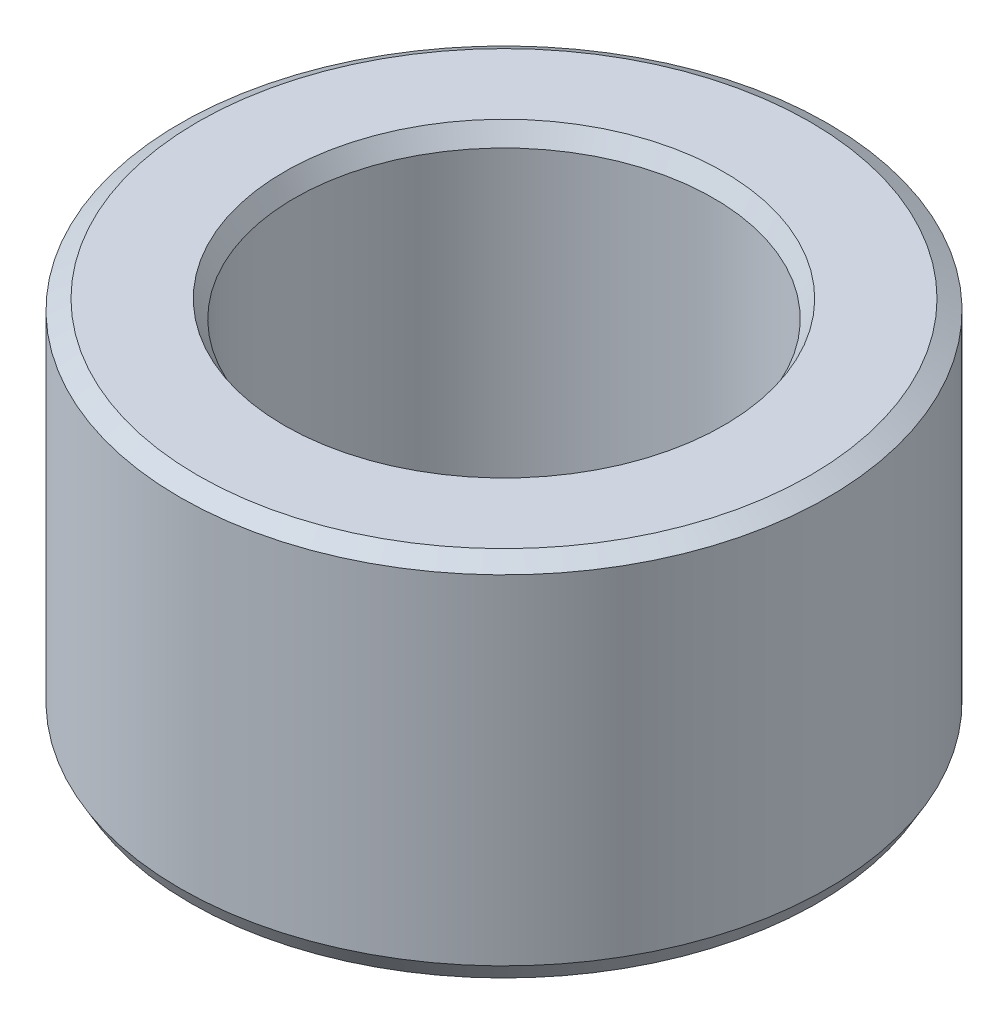
ISO-10303-21;
HEADER;
FILE_DESCRIPTION(('STEP AP214'),'2;1');
FILE_NAME('part.step','',(''),(''),'','','');
FILE_SCHEMA(('AUTOMOTIVE_DESIGN { 1 0 10303 214 1 1 1 1 }'));
ENDSEC;
DATA;
#1=APPLICATION_CONTEXT('core data for automotive mechanical design processes');
#2=APPLICATION_PROTOCOL_DEFINITION('international standard','automotive_design',2000,#1);
#3=PRODUCT_CONTEXT('',#1,'mechanical');
#4=PRODUCT('Part','Part','',(#3));
#5=PRODUCT_RELATED_PRODUCT_CATEGORY('part','',(#4));
#6=PRODUCT_DEFINITION_FORMATION('','',#4);
#7=PRODUCT_DEFINITION_CONTEXT('part definition',#1,'design');
#8=PRODUCT_DEFINITION('design','',#6,#7);
#9=PRODUCT_DEFINITION_SHAPE('','',#8);
#10=(LENGTH_UNIT() NAMED_UNIT(*) SI_UNIT(.MILLI.,.METRE.));
#11=(NAMED_UNIT(*) PLANE_ANGLE_UNIT() SI_UNIT($,.RADIAN.));
#12=(NAMED_UNIT(*) SI_UNIT($,.STERADIAN.) SOLID_ANGLE_UNIT());
#13=UNCERTAINTY_MEASURE_WITH_UNIT(LENGTH_MEASURE(1.E-05),#10,'distance_accuracy_value','');
#14=(GEOMETRIC_REPRESENTATION_CONTEXT(3) GLOBAL_UNCERTAINTY_ASSIGNED_CONTEXT((#13)) GLOBAL_UNIT_ASSIGNED_CONTEXT((#10,
#11,#12)) REPRESENTATION_CONTEXT('',''));
#15=CARTESIAN_POINT('',(0.,0.,0.));
#16=DIRECTION('',(0.,0.,1.));
#17=DIRECTION('',(1.,0.,0.));
#18=AXIS2_PLACEMENT_3D('',#15,#16,#17);
#19=CARTESIAN_POINT('',(0.,56.584841401643,0.));
#20=DIRECTION('',(0.,-1.,0.));
#21=DIRECTION('',(0.,0.,-1.));
#22=AXIS2_PLACEMENT_3D('',#19,#20,#21);
#23=CYLINDRICAL_SURFACE('',#22,50.);
#24=CARTESIAN_POINT('',(0.,2.73086601669988,0.));
#25=DIRECTION('',(0.,1.,0.));
#26=DIRECTION('',(0.,0.,1.));
#27=AXIS2_PLACEMENT_3D('',#24,#25,#26);
#28=CIRCLE('',#27,50.);
#29=CARTESIAN_POINT('',(0.,2.73086601669988,50.));
#30=VERTEX_POINT('',#29);
#31=EDGE_CURVE('E10',#30,#30,#28,.T.);
#32=ORIENTED_EDGE('',*,*,#31,.T.);
#33=EDGE_LOOP('',(#32));
#34=FACE_BOUND('',#33,.T.);
#35=CARTESIAN_POINT('',(0.,55.0081751717805,0.));
#36=DIRECTION('',(0.,1.,0.));
#37=DIRECTION('',(0.,0.,1.));
#38=AXIS2_PLACEMENT_3D('',#35,#36,#37);
#39=CIRCLE('',#38,50.);
#40=CARTESIAN_POINT('',(0.,55.0081751717805,50.));
#41=VERTEX_POINT('',#40);
#42=EDGE_CURVE('E50',#41,#41,#39,.F.);
#43=ORIENTED_EDGE('',*,*,#42,.T.);
#44=EDGE_LOOP('',(#43));
#45=FACE_BOUND('',#44,.T.);
#46=ADVANCED_FACE('F39',(#34,#45),#23,.T.);
#47=CARTESIAN_POINT('',(0.,56.584841401643,0.));
#48=DIRECTION('',(0.,1.,0.));
#49=DIRECTION('',(0.,0.,1.));
#50=AXIS2_PLACEMENT_3D('',#47,#48,#49);
#51=PLANE('',#50);
#52=CARTESIAN_POINT('',(0.,56.584841401643,0.));
#53=DIRECTION('',(0.,1.,0.));
#54=DIRECTION('',(0.,0.,1.));
#55=AXIS2_PLACEMENT_3D('',#52,#53,#54);
#56=CIRCLE('',#55,33.9172804695597);
#57=CARTESIAN_POINT('',(0.,56.584841401643,33.9172804695597));
#58=VERTEX_POINT('',#57);
#59=EDGE_CURVE('E58',#58,#58,#56,.F.);
#60=ORIENTED_EDGE('',*,*,#59,.T.);
#61=EDGE_LOOP('',(#60));
#62=FACE_BOUND('',#61,.T.);
#63=CARTESIAN_POINT('',(0.,56.584841401643,0.));
#64=DIRECTION('',(0.,1.,0.));
#65=DIRECTION('',(0.,0.,1.));
#66=AXIS2_PLACEMENT_3D('',#63,#64,#65);
#67=CIRCLE('',#66,47.2691339833001);
#68=CARTESIAN_POINT('',(0.,56.584841401643,47.2691339833001));
#69=VERTEX_POINT('',#68);
#70=EDGE_CURVE('E61',#69,#69,#67,.T.);
#71=ORIENTED_EDGE('',*,*,#70,.T.);
#72=EDGE_LOOP('',(#71));
#73=FACE_BOUND('',#72,.T.);
#74=ADVANCED_FACE('F88',(#62,#73),#51,.T.);
#75=CARTESIAN_POINT('',(0.,0.,0.));
#76=DIRECTION('',(0.,1.,0.));
#77=DIRECTION('',(0.,0.,1.));
#78=AXIS2_PLACEMENT_3D('',#75,#76,#77);
#79=PLANE('',#78);
#80=CARTESIAN_POINT('',(0.,0.,0.));
#81=DIRECTION('',(0.,1.,0.));
#82=DIRECTION('',(0.,0.,1.));
#83=AXIS2_PLACEMENT_3D('',#80,#81,#82);
#84=CIRCLE('',#83,35.0714802563971);
#85=CARTESIAN_POINT('',(0.,0.,35.0714802563971));
#86=VERTEX_POINT('',#85);
#87=EDGE_CURVE('E51',#86,#86,#84,.T.);
#88=ORIENTED_EDGE('',*,*,#87,.T.);
#89=EDGE_LOOP('',(#88));
#90=FACE_BOUND('',#89,.T.);
#91=CARTESIAN_POINT('',(0.,0.,0.));
#92=DIRECTION('',(0.,1.,0.));
#93=DIRECTION('',(0.,0.,1.));
#94=AXIS2_PLACEMENT_3D('',#91,#92,#93);
#95=CIRCLE('',#94,48.4233337701375);
#96=CARTESIAN_POINT('',(0.,0.,48.4233337701375));
#97=VERTEX_POINT('',#96);
#98=EDGE_CURVE('E54',#97,#97,#95,.F.);
#99=ORIENTED_EDGE('',*,*,#98,.T.);
#100=EDGE_LOOP('',(#99));
#101=FACE_BOUND('',#100,.T.);
#102=ADVANCED_FACE('F83',(#90,#101),#79,.F.);
#103=CARTESIAN_POINT('',(0.,56.584841401643,0.));
#104=DIRECTION('',(0.,-1.,0.));
#105=DIRECTION('',(0.,0.,-1.));
#106=AXIS2_PLACEMENT_3D('',#103,#104,#105);
#107=CYLINDRICAL_SURFACE('',#106,32.3406142396972);
#108=CARTESIAN_POINT('',(0.,53.8539753849431,0.));
#109=DIRECTION('',(0.,1.,0.));
#110=DIRECTION('',(0.,0.,1.));
#111=AXIS2_PLACEMENT_3D('',#108,#109,#110);
#112=CIRCLE('',#111,32.3406142396972);
#113=CARTESIAN_POINT('',(0.,53.8539753849431,32.3406142396972));
#114=VERTEX_POINT('',#113);
#115=EDGE_CURVE('E67',#114,#114,#112,.T.);
#116=ORIENTED_EDGE('',*,*,#115,.T.);
#117=EDGE_LOOP('',(#116));
#118=FACE_BOUND('',#117,.T.);
#119=CARTESIAN_POINT('',(0.,1.5766662298625,0.));
#120=DIRECTION('',(0.,1.,0.));
#121=DIRECTION('',(0.,0.,1.));
#122=AXIS2_PLACEMENT_3D('',#119,#120,#121);
#123=CIRCLE('',#122,32.3406142396972);
#124=CARTESIAN_POINT('',(0.,1.5766662298625,32.3406142396972));
#125=VERTEX_POINT('',#124);
#126=EDGE_CURVE('E69',#125,#125,#123,.F.);
#127=ORIENTED_EDGE('',*,*,#126,.T.);
#128=EDGE_LOOP('',(#127));
#129=FACE_BOUND('',#128,.T.);
#130=ADVANCED_FACE('F71',(#118,#129),#107,.F.);
#131=CARTESIAN_POINT('',(0.,53.8539753849431,0.));
#132=DIRECTION('',(0.,1.,0.));
#133=DIRECTION('',(0.,0.,1.));
#134=AXIS2_PLACEMENT_3D('',#131,#132,#133);
#135=CONICAL_SURFACE('',#134,32.3406142396972,0.523598775598304);
#136=ORIENTED_EDGE('',*,*,#59,.F.);
#137=EDGE_LOOP('',(#136));
#138=FACE_BOUND('',#137,.T.);
#139=ORIENTED_EDGE('',*,*,#115,.F.);
#140=EDGE_LOOP('',(#139));
#141=FACE_BOUND('',#140,.T.);
#142=ADVANCED_FACE('F77',(#138,#141),#135,.F.);
#143=CARTESIAN_POINT('',(0.,0.,0.));
#144=DIRECTION('',(0.,-1.,0.));
#145=DIRECTION('',(0.,0.,-1.));
#146=AXIS2_PLACEMENT_3D('',#143,#144,#145);
#147=CONICAL_SURFACE('',#146,35.0714802563971,1.04719755119659);
#148=ORIENTED_EDGE('',*,*,#126,.F.);
#149=EDGE_LOOP('',(#148));
#150=FACE_BOUND('',#149,.T.);
#151=ORIENTED_EDGE('',*,*,#87,.F.);
#152=EDGE_LOOP('',(#151));
#153=FACE_BOUND('',#152,.T.);
#154=ADVANCED_FACE('F73',(#150,#153),#147,.F.);
#155=CARTESIAN_POINT('',(0.,2.73086601669988,0.));
#156=DIRECTION('',(0.,1.,0.));
#157=DIRECTION('',(0.,0.,1.));
#158=AXIS2_PLACEMENT_3D('',#155,#156,#157);
#159=CONICAL_SURFACE('',#158,50.,0.523598775598304);
#160=ORIENTED_EDGE('',*,*,#98,.F.);
#161=EDGE_LOOP('',(#160));
#162=FACE_BOUND('',#161,.T.);
#163=ORIENTED_EDGE('',*,*,#31,.F.);
#164=EDGE_LOOP('',(#163));
#165=FACE_BOUND('',#164,.T.);
#166=ADVANCED_FACE('F76',(#162,#165),#159,.T.);
#167=CARTESIAN_POINT('',(0.,56.584841401643,0.));
#168=DIRECTION('',(0.,-1.,0.));
#169=DIRECTION('',(0.,0.,-1.));
#170=AXIS2_PLACEMENT_3D('',#167,#168,#169);
#171=CONICAL_SURFACE('',#170,47.2691339833001,1.04719755119659);
#172=ORIENTED_EDGE('',*,*,#42,.F.);
#173=EDGE_LOOP('',(#172));
#174=FACE_BOUND('',#173,.T.);
#175=ORIENTED_EDGE('',*,*,#70,.F.);
#176=EDGE_LOOP('',(#175));
#177=FACE_BOUND('',#176,.T.);
#178=ADVANCED_FACE('F45',(#174,#177),#171,.T.);
#179=CLOSED_SHELL('',(#46,#74,#102,#130,#142,#154,#166,#178));
#180=MANIFOLD_SOLID_BREP('B2',#179);
#181=ADVANCED_BREP_SHAPE_REPRESENTATION('',(#18,#180),#14);
#182=SHAPE_DEFINITION_REPRESENTATION(#9,#181);
ENDSEC;
END-ISO-10303-21;
